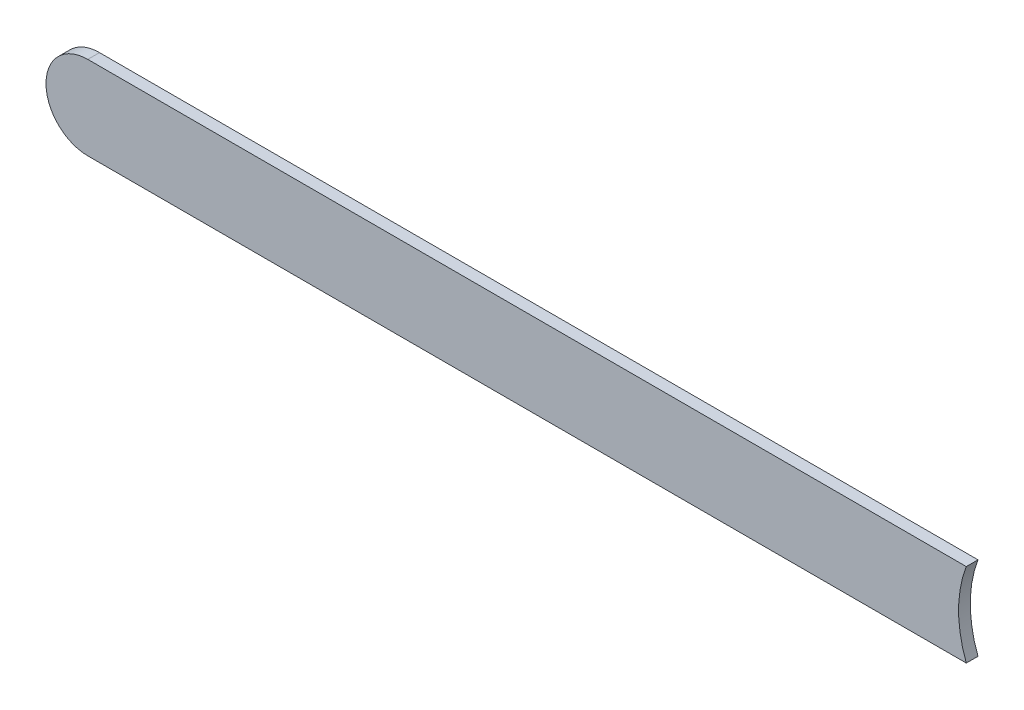
ISO-10303-21;
HEADER;
FILE_DESCRIPTION(('STEP AP214'),'2;1');
FILE_NAME('part.step','',(''),(''),'','','');
FILE_SCHEMA(('AUTOMOTIVE_DESIGN { 1 0 10303 214 1 1 1 1 }'));
ENDSEC;
DATA;
#1=APPLICATION_CONTEXT('core data for automotive mechanical design processes');
#2=APPLICATION_PROTOCOL_DEFINITION('international standard','automotive_design',2000,#1);
#3=PRODUCT_CONTEXT('',#1,'mechanical');
#4=PRODUCT('Part','Part','',(#3));
#5=PRODUCT_RELATED_PRODUCT_CATEGORY('part','',(#4));
#6=PRODUCT_DEFINITION_FORMATION('','',#4);
#7=PRODUCT_DEFINITION_CONTEXT('part definition',#1,'design');
#8=PRODUCT_DEFINITION('design','',#6,#7);
#9=PRODUCT_DEFINITION_SHAPE('','',#8);
#10=(LENGTH_UNIT() NAMED_UNIT(*) SI_UNIT(.MILLI.,.METRE.));
#11=(NAMED_UNIT(*) PLANE_ANGLE_UNIT() SI_UNIT($,.RADIAN.));
#12=(NAMED_UNIT(*) SI_UNIT($,.STERADIAN.) SOLID_ANGLE_UNIT());
#13=UNCERTAINTY_MEASURE_WITH_UNIT(LENGTH_MEASURE(1.E-05),#10,'distance_accuracy_value','');
#14=(GEOMETRIC_REPRESENTATION_CONTEXT(3) GLOBAL_UNCERTAINTY_ASSIGNED_CONTEXT((#13)) GLOBAL_UNIT_ASSIGNED_CONTEXT((#10,
#11,#12)) REPRESENTATION_CONTEXT('',''));
#15=CARTESIAN_POINT('',(0.,0.,0.));
#16=DIRECTION('',(0.,0.,1.));
#17=DIRECTION('',(1.,0.,0.));
#18=AXIS2_PLACEMENT_3D('',#15,#16,#17);
#19=CARTESIAN_POINT('',(91.4150064,101.0600468,0.));
#20=DIRECTION('',(0.,1.,0.));
#21=DIRECTION('',(1.,0.,0.));
#22=AXIS2_PLACEMENT_3D('',#19,#20,#21);
#23=PLANE('',#22);
#24=DIRECTION('',(1.,0.,0.));
#25=VECTOR('',#24,1.);
#26=CARTESIAN_POINT('',(91.4150064,101.0600468,0.03556));
#27=LINE('',#26,#25);
#28=CARTESIAN_POINT('',(91.4150064,101.0600468,0.03556));
#29=VERTEX_POINT('',#28);
#30=CARTESIAN_POINT('',(94.0847522205022,101.0600468,0.03556));
#31=VERTEX_POINT('',#30);
#32=EDGE_CURVE('E11',#29,#31,#27,.T.);
#33=ORIENTED_EDGE('',*,*,#32,.F.);
#34=DIRECTION('',(0.,0.,1.));
#35=VECTOR('',#34,1.);
#36=CARTESIAN_POINT('',(91.4150064,101.0600468,0.));
#37=LINE('',#36,#35);
#38=CARTESIAN_POINT('',(91.4150064,101.0600468,0.));
#39=VERTEX_POINT('',#38);
#40=EDGE_CURVE('E24',#39,#29,#37,.T.);
#41=ORIENTED_EDGE('',*,*,#40,.F.);
#42=DIRECTION('',(1.,0.,0.));
#43=VECTOR('',#42,1.);
#44=CARTESIAN_POINT('',(91.4150064,101.0600468,0.));
#45=LINE('',#44,#43);
#46=CARTESIAN_POINT('',(94.0847522205022,101.0600468,0.));
#47=VERTEX_POINT('',#46);
#48=EDGE_CURVE('E75',#39,#47,#45,.T.);
#49=ORIENTED_EDGE('',*,*,#48,.T.);
#50=DIRECTION('',(0.,0.,1.));
#51=VECTOR('',#50,1.);
#52=CARTESIAN_POINT('',(94.0847522205022,101.0600468,0.));
#53=LINE('',#52,#51);
#54=EDGE_CURVE('E37',#47,#31,#53,.T.);
#55=ORIENTED_EDGE('',*,*,#54,.T.);
#56=EDGE_LOOP('',(#33,#41,#49,#55));
#57=FACE_BOUND('',#56,.T.);
#58=ADVANCED_FACE('F17',(#57),#23,.F.);
#59=CARTESIAN_POINT('',(94.41690032,101.1870468,0.));
#60=DIRECTION('',(0.,0.,-1.));
#61=DIRECTION('',(1.,0.,0.));
#62=AXIS2_PLACEMENT_3D('',#59,#60,#61);
#63=CYLINDRICAL_SURFACE('',#62,0.3556);
#64=DIRECTION('',(0.,0.,1.));
#65=VECTOR('',#64,1.);
#66=CARTESIAN_POINT('',(94.0847522205022,101.3140468,0.));
#67=LINE('',#66,#65);
#68=CARTESIAN_POINT('',(94.0847522205022,101.3140468,0.));
#69=VERTEX_POINT('',#68);
#70=CARTESIAN_POINT('',(94.0847522205022,101.3140468,0.03556));
#71=VERTEX_POINT('',#70);
#72=EDGE_CURVE('E67',#69,#71,#67,.T.);
#73=ORIENTED_EDGE('',*,*,#72,.T.);
#74=CARTESIAN_POINT('',(94.41690032,101.1870468,0.03556));
#75=DIRECTION('',(0.,0.,1.));
#76=DIRECTION('',(1.,0.,0.));
#77=AXIS2_PLACEMENT_3D('',#74,#75,#76);
#78=CIRCLE('',#77,0.3556);
#79=EDGE_CURVE('E82',#71,#31,#78,.T.);
#80=ORIENTED_EDGE('',*,*,#79,.T.);
#81=ORIENTED_EDGE('',*,*,#54,.F.);
#82=CARTESIAN_POINT('',(94.41690032,101.1870468,0.));
#83=DIRECTION('',(0.,0.,1.));
#84=DIRECTION('',(1.,0.,0.));
#85=AXIS2_PLACEMENT_3D('',#82,#83,#84);
#86=CIRCLE('',#85,0.3556);
#87=EDGE_CURVE('E80',#69,#47,#86,.T.);
#88=ORIENTED_EDGE('',*,*,#87,.F.);
#89=EDGE_LOOP('',(#73,#80,#81,#88));
#90=FACE_BOUND('',#89,.T.);
#91=ADVANCED_FACE('F88',(#90),#63,.F.);
#92=CARTESIAN_POINT('',(94.0847522205022,101.3140468,0.));
#93=DIRECTION('',(0.,-1.,0.));
#94=DIRECTION('',(-1.,0.,0.));
#95=AXIS2_PLACEMENT_3D('',#92,#93,#94);
#96=PLANE('',#95);
#97=DIRECTION('',(-1.,0.,0.));
#98=VECTOR('',#97,1.);
#99=CARTESIAN_POINT('',(94.41690032,101.3140468,0.03556));
#100=LINE('',#99,#98);
#101=CARTESIAN_POINT('',(91.4150064,101.3140468,0.03556));
#102=VERTEX_POINT('',#101);
#103=EDGE_CURVE('E71',#71,#102,#100,.T.);
#104=ORIENTED_EDGE('',*,*,#103,.F.);
#105=ORIENTED_EDGE('',*,*,#72,.F.);
#106=DIRECTION('',(-1.,0.,0.));
#107=VECTOR('',#106,1.);
#108=CARTESIAN_POINT('',(94.41690032,101.3140468,0.));
#109=LINE('',#108,#107);
#110=CARTESIAN_POINT('',(91.4150064,101.3140468,0.));
#111=VERTEX_POINT('',#110);
#112=EDGE_CURVE('E63',#69,#111,#109,.T.);
#113=ORIENTED_EDGE('',*,*,#112,.T.);
#114=DIRECTION('',(0.,0.,1.));
#115=VECTOR('',#114,1.);
#116=CARTESIAN_POINT('',(91.4150064,101.3140468,0.));
#117=LINE('',#116,#115);
#118=EDGE_CURVE('E53',#111,#102,#117,.T.);
#119=ORIENTED_EDGE('',*,*,#118,.T.);
#120=EDGE_LOOP('',(#104,#105,#113,#119));
#121=FACE_BOUND('',#120,.T.);
#122=ADVANCED_FACE('F66',(#121),#96,.F.);
#123=CARTESIAN_POINT('',(91.4150064,101.1870468,0.));
#124=DIRECTION('',(0.,0.,-1.));
#125=DIRECTION('',(-1.1189649382048E-13,1.,0.));
#126=AXIS2_PLACEMENT_3D('',#123,#124,#125);
#127=CYLINDRICAL_SURFACE('',#126,0.127000000000005);
#128=CARTESIAN_POINT('',(91.4150064,101.1870468,0.03556));
#129=DIRECTION('',(0.,0.,1.));
#130=DIRECTION('',(-1.1189649382048E-13,1.,0.));
#131=AXIS2_PLACEMENT_3D('',#128,#129,#130);
#132=CIRCLE('',#131,0.127000000000005);
#133=EDGE_CURVE('E59',#102,#29,#132,.T.);
#134=ORIENTED_EDGE('',*,*,#133,.F.);
#135=ORIENTED_EDGE('',*,*,#118,.F.);
#136=CARTESIAN_POINT('',(91.4150064,101.1870468,0.));
#137=DIRECTION('',(0.,0.,1.));
#138=DIRECTION('',(-1.1189649382048E-13,1.,0.));
#139=AXIS2_PLACEMENT_3D('',#136,#137,#138);
#140=CIRCLE('',#139,0.127000000000005);
#141=EDGE_CURVE('E57',#111,#39,#140,.T.);
#142=ORIENTED_EDGE('',*,*,#141,.T.);
#143=ORIENTED_EDGE('',*,*,#40,.T.);
#144=EDGE_LOOP('',(#134,#135,#142,#143));
#145=FACE_BOUND('',#144,.T.);
#146=ADVANCED_FACE('F55',(#145),#127,.T.);
#147=CARTESIAN_POINT('',(91.4150064,101.0600468,0.));
#148=DIRECTION('',(0.,0.,-1.));
#149=DIRECTION('',(-1.,0.,0.));
#150=AXIS2_PLACEMENT_3D('',#147,#148,#149);
#151=PLANE('',#150);
#152=ORIENTED_EDGE('',*,*,#48,.F.);
#153=ORIENTED_EDGE('',*,*,#141,.F.);
#154=ORIENTED_EDGE('',*,*,#112,.F.);
#155=ORIENTED_EDGE('',*,*,#87,.T.);
#156=EDGE_LOOP('',(#152,#153,#154,#155));
#157=FACE_BOUND('',#156,.T.);
#158=ADVANCED_FACE('F74',(#157),#151,.T.);
#159=CARTESIAN_POINT('',(91.4150064,101.0600468,0.03556));
#160=DIRECTION('',(0.,0.,-1.));
#161=DIRECTION('',(-1.,0.,0.));
#162=AXIS2_PLACEMENT_3D('',#159,#160,#161);
#163=PLANE('',#162);
#164=ORIENTED_EDGE('',*,*,#133,.T.);
#165=ORIENTED_EDGE('',*,*,#32,.T.);
#166=ORIENTED_EDGE('',*,*,#79,.F.);
#167=ORIENTED_EDGE('',*,*,#103,.T.);
#168=EDGE_LOOP('',(#164,#165,#166,#167));
#169=FACE_BOUND('',#168,.T.);
#170=ADVANCED_FACE('F91',(#169),#163,.F.);
#171=CLOSED_SHELL('',(#58,#91,#122,#146,#158,#170));
#172=MANIFOLD_SOLID_BREP('B1',#171);
#173=ADVANCED_BREP_SHAPE_REPRESENTATION('',(#18,#172),#14);
#174=SHAPE_DEFINITION_REPRESENTATION(#9,#173);
ENDSEC;
END-ISO-10303-21;
